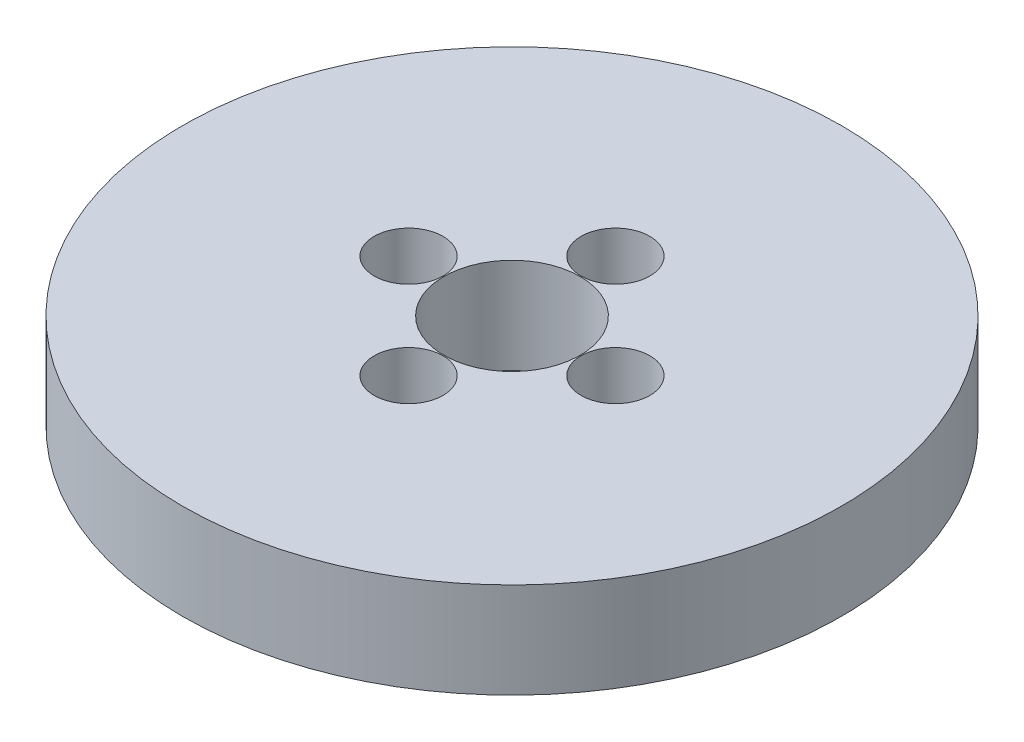
ISO-10303-21;
HEADER;
FILE_DESCRIPTION(('STEP AP214'),'2;1');
FILE_NAME('part.step','',(''),(''),'','','');
FILE_SCHEMA(('AUTOMOTIVE_DESIGN { 1 0 10303 214 1 1 1 1 }'));
ENDSEC;
DATA;
#1=APPLICATION_CONTEXT('core data for automotive mechanical design processes');
#2=APPLICATION_PROTOCOL_DEFINITION('international standard','automotive_design',2000,#1);
#3=PRODUCT_CONTEXT('',#1,'mechanical');
#4=PRODUCT('Part','Part','',(#3));
#5=PRODUCT_RELATED_PRODUCT_CATEGORY('part','',(#4));
#6=PRODUCT_DEFINITION_FORMATION('','',#4);
#7=PRODUCT_DEFINITION_CONTEXT('part definition',#1,'design');
#8=PRODUCT_DEFINITION('design','',#6,#7);
#9=PRODUCT_DEFINITION_SHAPE('','',#8);
#10=(LENGTH_UNIT() NAMED_UNIT(*) SI_UNIT(.MILLI.,.METRE.));
#11=(NAMED_UNIT(*) PLANE_ANGLE_UNIT() SI_UNIT($,.RADIAN.));
#12=(NAMED_UNIT(*) SI_UNIT($,.STERADIAN.) SOLID_ANGLE_UNIT());
#13=UNCERTAINTY_MEASURE_WITH_UNIT(LENGTH_MEASURE(1.E-05),#10,'distance_accuracy_value','');
#14=(GEOMETRIC_REPRESENTATION_CONTEXT(3) GLOBAL_UNCERTAINTY_ASSIGNED_CONTEXT((#13)) GLOBAL_UNIT_ASSIGNED_CONTEXT((#10,
#11,#12)) REPRESENTATION_CONTEXT('',''));
#15=CARTESIAN_POINT('',(0.,0.,0.));
#16=DIRECTION('',(0.,0.,1.));
#17=DIRECTION('',(1.,0.,0.));
#18=AXIS2_PLACEMENT_3D('',#15,#16,#17);
#19=CARTESIAN_POINT('',(0.,21.,0.));
#20=DIRECTION('',(0.,-1.,0.));
#21=DIRECTION('',(0.,0.,-1.));
#22=AXIS2_PLACEMENT_3D('',#19,#20,#21);
#23=CYLINDRICAL_SURFACE('',#22,72.5);
#24=CARTESIAN_POINT('',(0.,21.,0.));
#25=DIRECTION('',(0.,1.,0.));
#26=DIRECTION('',(0.,0.,1.));
#27=AXIS2_PLACEMENT_3D('',#24,#25,#26);
#28=CIRCLE('',#27,72.5);
#29=CARTESIAN_POINT('',(0.,21.,-72.5));
#30=VERTEX_POINT('',#29);
#31=EDGE_CURVE('E10',#30,#30,#28,.T.);
#32=CARTESIAN_POINT('',(0.,0.,0.));
#33=DIRECTION('',(0.,1.,0.));
#34=DIRECTION('',(0.,0.,1.));
#35=AXIS2_PLACEMENT_3D('',#32,#33,#34);
#36=CIRCLE('',#35,72.5);
#37=CARTESIAN_POINT('',(0.,0.,-72.5));
#38=VERTEX_POINT('',#37);
#39=EDGE_CURVE('E37',#38,#38,#36,.T.);
#40=CARTESIAN_POINT('',(0.,21.,-72.5));
#41=CARTESIAN_POINT('',(0.,20.78125,-72.5));
#42=CARTESIAN_POINT('',(0.,20.5625,-72.5));
#43=CARTESIAN_POINT('',(0.,20.125,-72.5));
#44=CARTESIAN_POINT('',(0.,19.90625,-72.5));
#45=CARTESIAN_POINT('',(0.,19.46875,-72.5));
#46=CARTESIAN_POINT('',(0.,19.25,-72.5));
#47=CARTESIAN_POINT('',(0.,18.8125,-72.5));
#48=CARTESIAN_POINT('',(0.,18.59375,-72.5));
#49=CARTESIAN_POINT('',(0.,18.15625,-72.5));
#50=CARTESIAN_POINT('',(0.,17.9375,-72.5));
#51=CARTESIAN_POINT('',(0.,17.5,-72.5));
#52=CARTESIAN_POINT('',(0.,17.28125,-72.5));
#53=CARTESIAN_POINT('',(0.,16.84375,-72.5));
#54=CARTESIAN_POINT('',(0.,16.625,-72.5));
#55=CARTESIAN_POINT('',(0.,16.1875,-72.5));
#56=CARTESIAN_POINT('',(0.,15.96875,-72.5));
#57=CARTESIAN_POINT('',(0.,15.53125,-72.5));
#58=CARTESIAN_POINT('',(0.,15.3125,-72.5));
#59=CARTESIAN_POINT('',(0.,14.875,-72.5));
#60=CARTESIAN_POINT('',(0.,14.65625,-72.5));
#61=CARTESIAN_POINT('',(0.,14.21875,-72.5));
#62=CARTESIAN_POINT('',(0.,14.,-72.5));
#63=CARTESIAN_POINT('',(0.,13.5625,-72.5));
#64=CARTESIAN_POINT('',(0.,13.34375,-72.5));
#65=CARTESIAN_POINT('',(0.,12.90625,-72.5));
#66=CARTESIAN_POINT('',(0.,12.6875,-72.5));
#67=CARTESIAN_POINT('',(0.,12.25,-72.5));
#68=CARTESIAN_POINT('',(0.,12.03125,-72.5));
#69=CARTESIAN_POINT('',(0.,11.59375,-72.5));
#70=CARTESIAN_POINT('',(0.,11.375,-72.5));
#71=CARTESIAN_POINT('',(0.,10.9375,-72.5));
#72=CARTESIAN_POINT('',(0.,10.71875,-72.5));
#73=CARTESIAN_POINT('',(0.,10.28125,-72.5));
#74=CARTESIAN_POINT('',(0.,10.0625,-72.5));
#75=CARTESIAN_POINT('',(0.,9.625,-72.5));
#76=CARTESIAN_POINT('',(0.,9.40625,-72.5));
#77=CARTESIAN_POINT('',(0.,8.96875,-72.5));
#78=CARTESIAN_POINT('',(0.,8.75,-72.5));
#79=CARTESIAN_POINT('',(0.,8.3125,-72.5));
#80=CARTESIAN_POINT('',(0.,8.09375,-72.5));
#81=CARTESIAN_POINT('',(0.,7.65625,-72.5));
#82=CARTESIAN_POINT('',(0.,7.4375,-72.5));
#83=CARTESIAN_POINT('',(0.,7.,-72.5));
#84=CARTESIAN_POINT('',(0.,6.78125,-72.5));
#85=CARTESIAN_POINT('',(0.,6.34375,-72.5));
#86=CARTESIAN_POINT('',(0.,6.125,-72.5));
#87=CARTESIAN_POINT('',(0.,5.6875,-72.5));
#88=CARTESIAN_POINT('',(0.,5.46875,-72.5));
#89=CARTESIAN_POINT('',(0.,5.03125,-72.5));
#90=CARTESIAN_POINT('',(0.,4.8125,-72.5));
#91=CARTESIAN_POINT('',(0.,4.375,-72.5));
#92=CARTESIAN_POINT('',(0.,4.15625,-72.5));
#93=CARTESIAN_POINT('',(0.,3.71875,-72.5));
#94=CARTESIAN_POINT('',(0.,3.5,-72.5));
#95=CARTESIAN_POINT('',(0.,3.0625,-72.5));
#96=CARTESIAN_POINT('',(0.,2.84375,-72.5));
#97=CARTESIAN_POINT('',(0.,2.40625,-72.5));
#98=CARTESIAN_POINT('',(0.,2.1875,-72.5));
#99=CARTESIAN_POINT('',(0.,1.75,-72.5));
#100=CARTESIAN_POINT('',(0.,1.53125,-72.5));
#101=CARTESIAN_POINT('',(0.,1.09375,-72.5));
#102=CARTESIAN_POINT('',(0.,0.875000000000001,-72.5));
#103=CARTESIAN_POINT('',(0.,0.4375,-72.5));
#104=CARTESIAN_POINT('',(0.,0.21875,-72.5));
#105=CARTESIAN_POINT('',(0.,0.,-72.5));
#106=B_SPLINE_CURVE_WITH_KNOTS('',3,(#40,#41,#42,#43,#44,#45,#46,#47,#48,#49,#50,#51,#52,#53,
#54,#55,#56,#57,#58,#59,#60,#61,#62,#63,#64,#65,#66,#67,#68,#69,#70,#71,#72,#73,#74,#75,#76,#77,
#78,#79,#80,#81,#82,#83,#84,#85,#86,#87,#88,#89,#90,#91,#92,#93,#94,#95,#96,#97,#98,#99,#100,
#101,#102,#103,#104,#105),.UNSPECIFIED.,.F.,.F.,(4,2,2,2,2,2,2,2,2,2,2,2,2,2,2,2,2,2,2,2,2,2,2,
2,2,2,2,2,2,2,2,2,4),(0.,0.656249999999997,1.3125,1.96875,2.625,3.28125,3.9375,4.59375,5.25,
5.90625,6.5625,7.21875,7.875,8.53125,9.1875,9.84375,10.5,11.15625,11.8125,12.46875,13.125,
13.78125,14.4375,15.09375,15.75,16.40625,17.0625,17.71875,18.375,19.03125,19.6875,20.34375,21.),.UNSPECIFIED.);
#107=EDGE_CURVE('BSEAM40',#30,#38,#106,.T.);
#108=ORIENTED_EDGE('',*,*,#31,.F.);
#109=ORIENTED_EDGE('',*,*,#39,.T.);
#110=ORIENTED_EDGE('',*,*,#107,.T.);
#111=ORIENTED_EDGE('',*,*,#107,.F.);
#112=EDGE_LOOP('',(#108,#110,#109,#111));
#113=FACE_BOUND('',#112,.T.);
#114=ADVANCED_FACE('F40',(#113),#23,.T.);
#115=CARTESIAN_POINT('',(0.,21.,0.));
#116=DIRECTION('',(0.,1.,0.));
#117=DIRECTION('',(0.,0.,1.));
#118=AXIS2_PLACEMENT_3D('',#115,#116,#117);
#119=PLANE('',#118);
#120=CARTESIAN_POINT('',(0.,21.,22.7546545319778));
#121=DIRECTION('',(0.,1.,0.));
#122=DIRECTION('',(1.,0.,0.));
#123=AXIS2_PLACEMENT_3D('',#120,#121,#122);
#124=CIRCLE('',#123,7.5701861680182);
#125=CARTESIAN_POINT('',(7.57018616801828,21.,22.7546545319778));
#126=VERTEX_POINT('',#125);
#127=EDGE_CURVE('E71',#126,#126,#124,.T.);
#128=ORIENTED_EDGE('',*,*,#127,.F.);
#129=EDGE_LOOP('',(#128));
#130=FACE_BOUND('',#129,.T.);
#131=CARTESIAN_POINT('',(22.7546545319778,21.,0.));
#132=DIRECTION('',(0.,1.,0.));
#133=DIRECTION('',(0.,0.,-1.));
#134=AXIS2_PLACEMENT_3D('',#131,#132,#133);
#135=CIRCLE('',#134,7.5701861680182);
#136=CARTESIAN_POINT('',(22.7546545319778,21.,-7.5701861680182));
#137=VERTEX_POINT('',#136);
#138=EDGE_CURVE('E70',#137,#137,#135,.T.);
#139=ORIENTED_EDGE('',*,*,#138,.F.);
#140=EDGE_LOOP('',(#139));
#141=FACE_BOUND('',#140,.T.);
#142=CARTESIAN_POINT('',(-2.38342355010669E-13,21.,-22.7546545319778));
#143=DIRECTION('',(0.,1.,0.));
#144=DIRECTION('',(-1.,0.,0.));
#145=AXIS2_PLACEMENT_3D('',#142,#143,#144);
#146=CIRCLE('',#145,7.5701861680182);
#147=CARTESIAN_POINT('',(-7.57018616801844,21.,-22.7546545319778));
#148=VERTEX_POINT('',#147);
#149=EDGE_CURVE('E61',#148,#148,#146,.T.);
#150=ORIENTED_EDGE('',*,*,#149,.F.);
#151=EDGE_LOOP('',(#150));
#152=FACE_BOUND('',#151,.T.);
#153=CARTESIAN_POINT('',(-22.7546545319778,21.,0.));
#154=DIRECTION('',(0.,1.,0.));
#155=DIRECTION('',(0.,0.,1.));
#156=AXIS2_PLACEMENT_3D('',#153,#154,#155);
#157=CIRCLE('',#156,7.5701861680182);
#158=CARTESIAN_POINT('',(-22.7546545319778,21.,7.5701861680182));
#159=VERTEX_POINT('',#158);
#160=EDGE_CURVE('E54',#159,#159,#157,.T.);
#161=ORIENTED_EDGE('',*,*,#160,.F.);
#162=EDGE_LOOP('',(#161));
#163=FACE_BOUND('',#162,.T.);
#164=CARTESIAN_POINT('',(0.,21.,0.));
#165=DIRECTION('',(0.,1.,0.));
#166=DIRECTION('',(0.,0.,1.));
#167=AXIS2_PLACEMENT_3D('',#164,#165,#166);
#168=CIRCLE('',#167,15.);
#169=CARTESIAN_POINT('',(0.,21.,-15.));
#170=VERTEX_POINT('',#169);
#171=EDGE_CURVE('E50',#170,#170,#168,.T.);
#172=ORIENTED_EDGE('',*,*,#171,.F.);
#173=EDGE_LOOP('',(#172));
#174=FACE_BOUND('',#173,.T.);
#175=ORIENTED_EDGE('',*,*,#31,.T.);
#176=EDGE_LOOP('',(#175));
#177=FACE_BOUND('',#176,.T.);
#178=ADVANCED_FACE('F86',(#130,#141,#152,#163,#174,#177),#119,.T.);
#179=CARTESIAN_POINT('',(0.,0.,0.));
#180=DIRECTION('',(0.,1.,0.));
#181=DIRECTION('',(0.,0.,1.));
#182=AXIS2_PLACEMENT_3D('',#179,#180,#181);
#183=PLANE('',#182);
#184=CARTESIAN_POINT('',(0.,0.,0.));
#185=DIRECTION('',(0.,1.,0.));
#186=DIRECTION('',(0.,0.,1.));
#187=AXIS2_PLACEMENT_3D('',#184,#185,#186);
#188=CIRCLE('',#187,15.);
#189=CARTESIAN_POINT('',(0.,0.,-15.));
#190=VERTEX_POINT('',#189);
#191=EDGE_CURVE('E47',#190,#190,#188,.T.);
#192=ORIENTED_EDGE('',*,*,#191,.T.);
#193=EDGE_LOOP('',(#192));
#194=FACE_BOUND('',#193,.T.);
#195=ORIENTED_EDGE('',*,*,#39,.F.);
#196=EDGE_LOOP('',(#195));
#197=FACE_BOUND('',#196,.T.);
#198=ADVANCED_FACE('F93',(#194,#197),#183,.F.);
#199=CARTESIAN_POINT('',(0.,21.,0.));
#200=DIRECTION('',(0.,-1.,0.));
#201=DIRECTION('',(0.,0.,-1.));
#202=AXIS2_PLACEMENT_3D('',#199,#200,#201);
#203=CYLINDRICAL_SURFACE('',#202,15.);
#204=CARTESIAN_POINT('',(0.,21.,-15.));
#205=CARTESIAN_POINT('',(0.,20.78125,-15.));
#206=CARTESIAN_POINT('',(0.,20.5625,-15.));
#207=CARTESIAN_POINT('',(0.,20.125,-15.));
#208=CARTESIAN_POINT('',(0.,19.90625,-15.));
#209=CARTESIAN_POINT('',(0.,19.46875,-15.));
#210=CARTESIAN_POINT('',(0.,19.25,-15.));
#211=CARTESIAN_POINT('',(0.,18.8125,-15.));
#212=CARTESIAN_POINT('',(0.,18.59375,-15.));
#213=CARTESIAN_POINT('',(0.,18.15625,-15.));
#214=CARTESIAN_POINT('',(0.,17.9375,-15.));
#215=CARTESIAN_POINT('',(0.,17.5,-15.));
#216=CARTESIAN_POINT('',(0.,17.28125,-15.));
#217=CARTESIAN_POINT('',(0.,16.84375,-15.));
#218=CARTESIAN_POINT('',(0.,16.625,-15.));
#219=CARTESIAN_POINT('',(0.,16.1875,-15.));
#220=CARTESIAN_POINT('',(0.,15.96875,-15.));
#221=CARTESIAN_POINT('',(0.,15.53125,-15.));
#222=CARTESIAN_POINT('',(0.,15.3125,-15.));
#223=CARTESIAN_POINT('',(0.,14.875,-15.));
#224=CARTESIAN_POINT('',(0.,14.65625,-15.));
#225=CARTESIAN_POINT('',(0.,14.21875,-15.));
#226=CARTESIAN_POINT('',(0.,14.,-15.));
#227=CARTESIAN_POINT('',(0.,13.5625,-15.));
#228=CARTESIAN_POINT('',(0.,13.34375,-15.));
#229=CARTESIAN_POINT('',(0.,12.90625,-15.));
#230=CARTESIAN_POINT('',(0.,12.6875,-15.));
#231=CARTESIAN_POINT('',(0.,12.25,-15.));
#232=CARTESIAN_POINT('',(0.,12.03125,-15.));
#233=CARTESIAN_POINT('',(0.,11.59375,-15.));
#234=CARTESIAN_POINT('',(0.,11.375,-15.));
#235=CARTESIAN_POINT('',(0.,10.9375,-15.));
#236=CARTESIAN_POINT('',(0.,10.71875,-15.));
#237=CARTESIAN_POINT('',(0.,10.28125,-15.));
#238=CARTESIAN_POINT('',(0.,10.0625,-15.));
#239=CARTESIAN_POINT('',(0.,9.625,-15.));
#240=CARTESIAN_POINT('',(0.,9.40625,-15.));
#241=CARTESIAN_POINT('',(0.,8.96875,-15.));
#242=CARTESIAN_POINT('',(0.,8.75,-15.));
#243=CARTESIAN_POINT('',(0.,8.3125,-15.));
#244=CARTESIAN_POINT('',(0.,8.09375,-15.));
#245=CARTESIAN_POINT('',(0.,7.65625,-15.));
#246=CARTESIAN_POINT('',(0.,7.4375,-15.));
#247=CARTESIAN_POINT('',(0.,7.,-15.));
#248=CARTESIAN_POINT('',(0.,6.78125,-15.));
#249=CARTESIAN_POINT('',(0.,6.34375,-15.));
#250=CARTESIAN_POINT('',(0.,6.125,-15.));
#251=CARTESIAN_POINT('',(0.,5.6875,-15.));
#252=CARTESIAN_POINT('',(0.,5.46875,-15.));
#253=CARTESIAN_POINT('',(0.,5.03125,-15.));
#254=CARTESIAN_POINT('',(0.,4.8125,-15.));
#255=CARTESIAN_POINT('',(0.,4.375,-15.));
#256=CARTESIAN_POINT('',(0.,4.15625,-15.));
#257=CARTESIAN_POINT('',(0.,3.71875,-15.));
#258=CARTESIAN_POINT('',(0.,3.5,-15.));
#259=CARTESIAN_POINT('',(0.,3.0625,-15.));
#260=CARTESIAN_POINT('',(0.,2.84375,-15.));
#261=CARTESIAN_POINT('',(0.,2.40625,-15.));
#262=CARTESIAN_POINT('',(0.,2.1875,-15.));
#263=CARTESIAN_POINT('',(0.,1.75,-15.));
#264=CARTESIAN_POINT('',(0.,1.53125,-15.));
#265=CARTESIAN_POINT('',(0.,1.09375,-15.));
#266=CARTESIAN_POINT('',(0.,0.875000000000001,-15.));
#267=CARTESIAN_POINT('',(0.,0.4375,-15.));
#268=CARTESIAN_POINT('',(0.,0.21875,-15.));
#269=CARTESIAN_POINT('',(0.,0.,-15.));
#270=B_SPLINE_CURVE_WITH_KNOTS('',3,(#204,#205,#206,#207,#208,#209,#210,#211,#212,#213,#214,
#215,#216,#217,#218,#219,#220,#221,#222,#223,#224,#225,#226,#227,#228,#229,#230,#231,#232,#233,
#234,#235,#236,#237,#238,#239,#240,#241,#242,#243,#244,#245,#246,#247,#248,#249,#250,#251,#252,
#253,#254,#255,#256,#257,#258,#259,#260,#261,#262,#263,#264,#265,#266,#267,#268,#269),
.UNSPECIFIED.,.F.,.F.,(4,2,2,2,2,2,2,2,2,2,2,2,2,2,2,2,2,2,2,2,2,2,2,2,2,2,2,2,2,2,2,2,4),(0.,
0.656250000000001,1.3125,1.96875,2.625,3.28125,3.9375,4.59375,5.25,5.90625,6.5625,7.21875,7.875,
8.53125,9.1875,9.84375,10.5,11.15625,11.8125,12.46875,13.125,13.78125,14.4375,15.09375,15.75,
16.40625,17.0625,17.71875,18.375,19.03125,19.6875,20.34375,21.),.UNSPECIFIED.);
#271=EDGE_CURVE('BSEAM101',#170,#190,#270,.T.);
#272=ORIENTED_EDGE('',*,*,#171,.T.);
#273=ORIENTED_EDGE('',*,*,#191,.F.);
#274=ORIENTED_EDGE('',*,*,#271,.T.);
#275=ORIENTED_EDGE('',*,*,#271,.F.);
#276=EDGE_LOOP('',(#272,#274,#273,#275));
#277=FACE_BOUND('',#276,.T.);
#278=ADVANCED_FACE('F101',(#277),#203,.F.);
#279=CARTESIAN_POINT('',(-22.7546545319778,5.5636138987643,0.));
#280=DIRECTION('',(0.,1.,0.));
#281=DIRECTION('',(0.,0.,1.));
#282=AXIS2_PLACEMENT_3D('',#279,#280,#281);
#283=CYLINDRICAL_SURFACE('',#282,7.5701861680182);
#284=CARTESIAN_POINT('',(-22.7546545319778,5.5636138987643,0.));
#285=DIRECTION('',(0.,1.,0.));
#286=DIRECTION('',(0.,0.,1.));
#287=AXIS2_PLACEMENT_3D('',#284,#285,#286);
#288=CIRCLE('',#287,7.5701861680182);
#289=CARTESIAN_POINT('',(-22.7546545319778,5.5636138987643,7.5701861680182));
#290=VERTEX_POINT('',#289);
#291=EDGE_CURVE('E55',#290,#290,#288,.T.);
#292=ORIENTED_EDGE('',*,*,#291,.F.);
#293=EDGE_LOOP('',(#292));
#294=FACE_BOUND('',#293,.T.);
#295=ORIENTED_EDGE('',*,*,#160,.T.);
#296=EDGE_LOOP('',(#295));
#297=FACE_BOUND('',#296,.T.);
#298=ADVANCED_FACE('F102',(#294,#297),#283,.F.);
#299=CARTESIAN_POINT('',(-22.7546545319778,5.5636138987643,0.));
#300=DIRECTION('',(0.,1.,0.));
#301=DIRECTION('',(0.,0.,1.));
#302=AXIS2_PLACEMENT_3D('',#299,#300,#301);
#303=PLANE('',#302);
#304=ORIENTED_EDGE('',*,*,#291,.T.);
#305=EDGE_LOOP('',(#304));
#306=FACE_BOUND('',#305,.T.);
#307=ADVANCED_FACE('F133',(#306),#303,.T.);
#308=CARTESIAN_POINT('',(-2.38342355010669E-13,5.5636138987643,-22.7546545319778));
#309=DIRECTION('',(0.,1.,0.));
#310=DIRECTION('',(0.,0.,1.));
#311=AXIS2_PLACEMENT_3D('',#308,#309,#310);
#312=CYLINDRICAL_SURFACE('',#311,7.5701861680182);
#313=CARTESIAN_POINT('',(-2.38342355010669E-13,5.5636138987643,-22.7546545319778));
#314=DIRECTION('',(0.,1.,0.));
#315=DIRECTION('',(-1.,0.,0.));
#316=AXIS2_PLACEMENT_3D('',#313,#314,#315);
#317=CIRCLE('',#316,7.5701861680182);
#318=CARTESIAN_POINT('',(-7.57018616801844,5.5636138987643,-22.7546545319778));
#319=VERTEX_POINT('',#318);
#320=EDGE_CURVE('E63',#319,#319,#317,.T.);
#321=ORIENTED_EDGE('',*,*,#320,.F.);
#322=EDGE_LOOP('',(#321));
#323=FACE_BOUND('',#322,.T.);
#324=ORIENTED_EDGE('',*,*,#149,.T.);
#325=EDGE_LOOP('',(#324));
#326=FACE_BOUND('',#325,.T.);
#327=ADVANCED_FACE('F142',(#323,#326),#312,.F.);
#328=CARTESIAN_POINT('',(-2.38342355010669E-13,5.5636138987643,-22.7546545319778));
#329=DIRECTION('',(0.,1.,0.));
#330=DIRECTION('',(-1.,0.,0.));
#331=AXIS2_PLACEMENT_3D('',#328,#329,#330);
#332=PLANE('',#331);
#333=ORIENTED_EDGE('',*,*,#320,.T.);
#334=EDGE_LOOP('',(#333));
#335=FACE_BOUND('',#334,.T.);
#336=ADVANCED_FACE('F156',(#335),#332,.T.);
#337=CARTESIAN_POINT('',(22.7546545319778,5.5636138987643,0.));
#338=DIRECTION('',(0.,1.,0.));
#339=DIRECTION('',(0.,0.,1.));
#340=AXIS2_PLACEMENT_3D('',#337,#338,#339);
#341=CYLINDRICAL_SURFACE('',#340,7.5701861680182);
#342=CARTESIAN_POINT('',(22.7546545319778,5.5636138987643,0.));
#343=DIRECTION('',(0.,1.,0.));
#344=DIRECTION('',(0.,0.,-1.));
#345=AXIS2_PLACEMENT_3D('',#342,#343,#344);
#346=CIRCLE('',#345,7.5701861680182);
#347=CARTESIAN_POINT('',(22.7546545319778,5.5636138987643,-7.5701861680182));
#348=VERTEX_POINT('',#347);
#349=EDGE_CURVE('E69',#348,#348,#346,.T.);
#350=ORIENTED_EDGE('',*,*,#349,.F.);
#351=EDGE_LOOP('',(#350));
#352=FACE_BOUND('',#351,.T.);
#353=ORIENTED_EDGE('',*,*,#138,.T.);
#354=EDGE_LOOP('',(#353));
#355=FACE_BOUND('',#354,.T.);
#356=ADVANCED_FACE('F164',(#352,#355),#341,.F.);
#357=CARTESIAN_POINT('',(22.7546545319778,5.5636138987643,0.));
#358=DIRECTION('',(0.,1.,0.));
#359=DIRECTION('',(0.,0.,-1.));
#360=AXIS2_PLACEMENT_3D('',#357,#358,#359);
#361=PLANE('',#360);
#362=ORIENTED_EDGE('',*,*,#349,.T.);
#363=EDGE_LOOP('',(#362));
#364=FACE_BOUND('',#363,.T.);
#365=ADVANCED_FACE('F83',(#364),#361,.T.);
#366=CARTESIAN_POINT('',(0.,5.5636138987643,22.7546545319778));
#367=DIRECTION('',(0.,1.,0.));
#368=DIRECTION('',(0.,0.,1.));
#369=AXIS2_PLACEMENT_3D('',#366,#367,#368);
#370=CYLINDRICAL_SURFACE('',#369,7.5701861680182);
#371=CARTESIAN_POINT('',(0.,5.5636138987643,22.7546545319778));
#372=DIRECTION('',(0.,1.,0.));
#373=DIRECTION('',(1.,0.,0.));
#374=AXIS2_PLACEMENT_3D('',#371,#372,#373);
#375=CIRCLE('',#374,7.5701861680182);
#376=CARTESIAN_POINT('',(7.57018616801828,5.5636138987643,22.7546545319778));
#377=VERTEX_POINT('',#376);
#378=EDGE_CURVE('E59',#377,#377,#375,.T.);
#379=ORIENTED_EDGE('',*,*,#378,.F.);
#380=EDGE_LOOP('',(#379));
#381=FACE_BOUND('',#380,.T.);
#382=ORIENTED_EDGE('',*,*,#127,.T.);
#383=EDGE_LOOP('',(#382));
#384=FACE_BOUND('',#383,.T.);
#385=ADVANCED_FACE('F81',(#381,#384),#370,.F.);
#386=CARTESIAN_POINT('',(0.,5.5636138987643,22.7546545319778));
#387=DIRECTION('',(0.,1.,0.));
#388=DIRECTION('',(1.,0.,0.));
#389=AXIS2_PLACEMENT_3D('',#386,#387,#388);
#390=PLANE('',#389);
#391=ORIENTED_EDGE('',*,*,#378,.T.);
#392=EDGE_LOOP('',(#391));
#393=FACE_BOUND('',#392,.T.);
#394=ADVANCED_FACE('F78',(#393),#390,.T.);
#395=CLOSED_SHELL('',(#114,#178,#198,#278,#298,#307,#327,#336,#356,#365,#385,#394));
#396=MANIFOLD_SOLID_BREP('B2',#395);
#397=ADVANCED_BREP_SHAPE_REPRESENTATION('',(#18,#396),#14);
#398=SHAPE_DEFINITION_REPRESENTATION(#9,#397);
ENDSEC;
END-ISO-10303-21;
